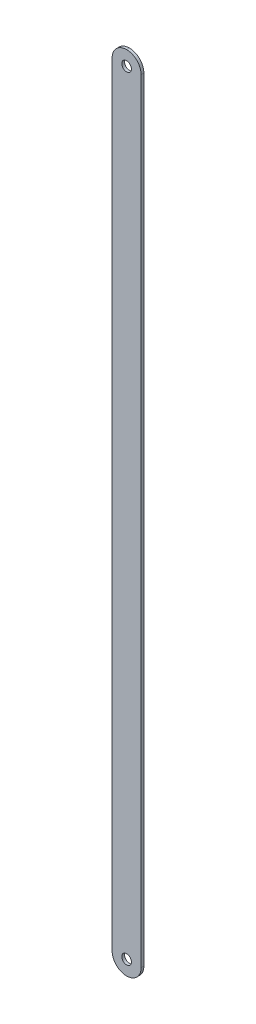
ISO-10303-21;
HEADER;
FILE_DESCRIPTION(('STEP AP214'),'2;1');
FILE_NAME('part.step','',(''),(''),'','','');
FILE_SCHEMA(('AUTOMOTIVE_DESIGN { 1 0 10303 214 1 1 1 1 }'));
ENDSEC;
DATA;
#1=APPLICATION_CONTEXT('core data for automotive mechanical design processes');
#2=APPLICATION_PROTOCOL_DEFINITION('international standard','automotive_design',2000,#1);
#3=PRODUCT_CONTEXT('',#1,'mechanical');
#4=PRODUCT('Part','Part','',(#3));
#5=PRODUCT_RELATED_PRODUCT_CATEGORY('part','',(#4));
#6=PRODUCT_DEFINITION_FORMATION('','',#4);
#7=PRODUCT_DEFINITION_CONTEXT('part definition',#1,'design');
#8=PRODUCT_DEFINITION('design','',#6,#7);
#9=PRODUCT_DEFINITION_SHAPE('','',#8);
#10=(LENGTH_UNIT() NAMED_UNIT(*) SI_UNIT(.MILLI.,.METRE.));
#11=(NAMED_UNIT(*) PLANE_ANGLE_UNIT() SI_UNIT($,.RADIAN.));
#12=(NAMED_UNIT(*) SI_UNIT($,.STERADIAN.) SOLID_ANGLE_UNIT());
#13=UNCERTAINTY_MEASURE_WITH_UNIT(LENGTH_MEASURE(1.E-05),#10,'distance_accuracy_value','');
#14=(GEOMETRIC_REPRESENTATION_CONTEXT(3) GLOBAL_UNCERTAINTY_ASSIGNED_CONTEXT((#13)) GLOBAL_UNIT_ASSIGNED_CONTEXT((#10,
#11,#12)) REPRESENTATION_CONTEXT('',''));
#15=CARTESIAN_POINT('',(0.,0.,0.));
#16=DIRECTION('',(0.,0.,1.));
#17=DIRECTION('',(1.,0.,0.));
#18=AXIS2_PLACEMENT_3D('',#15,#16,#17);
#19=CARTESIAN_POINT('',(-4.76250000000003,263.525000000001,0.911859999999876));
#20=DIRECTION('',(0.,0.,-0.999999999999998));
#21=DIRECTION('',(-1.,0.,0.));
#22=AXIS2_PLACEMENT_3D('',#19,#20,#21);
#23=PLANE('',#22);
#24=CARTESIAN_POINT('',(0.,258.7625,0.911859999999945));
#25=DIRECTION('',(0.,0.,0.999999999999998));
#26=DIRECTION('',(1.,0.,0.));
#27=AXIS2_PLACEMENT_3D('',#24,#25,#26);
#28=CIRCLE('',#27,1.58749999999999);
#29=CARTESIAN_POINT('',(1.58750000000001,258.7625,0.911859999999945));
#30=VERTEX_POINT('',#29);
#31=EDGE_CURVE('E114',#30,#30,#28,.T.);
#32=ORIENTED_EDGE('',*,*,#31,.F.);
#33=EDGE_LOOP('',(#32));
#34=FACE_BOUND('',#33,.T.);
#35=CARTESIAN_POINT('',(0.,4.76250000000011,0.91186));
#36=DIRECTION('',(0.,0.,0.999999999999998));
#37=DIRECTION('',(1.,0.,0.));
#38=AXIS2_PLACEMENT_3D('',#35,#36,#37);
#39=CIRCLE('',#38,1.58749999999999);
#40=CARTESIAN_POINT('',(1.58750000000001,4.76250000000011,0.91186));
#41=VERTEX_POINT('',#40);
#42=EDGE_CURVE('E171',#41,#41,#39,.T.);
#43=ORIENTED_EDGE('',*,*,#42,.F.);
#44=EDGE_LOOP('',(#43));
#45=FACE_BOUND('',#44,.T.);
#46=DIRECTION('',(0.,-1.,0.));
#47=VECTOR('',#46,1.);
#48=CARTESIAN_POINT('',(-4.76250000000003,263.525000000001,0.911859999999876));
#49=LINE('',#48,#47);
#50=CARTESIAN_POINT('',(-4.76250000000002,258.7625,0.911859999999876));
#51=VERTEX_POINT('',#50);
#52=CARTESIAN_POINT('',(-4.76250000000001,4.76249999999986,0.91185999999982));
#53=VERTEX_POINT('',#52);
#54=EDGE_CURVE('E159',#51,#53,#49,.T.);
#55=ORIENTED_EDGE('',*,*,#54,.T.);
#56=CARTESIAN_POINT('',(0.,4.76250000000011,0.91186));
#57=DIRECTION('',(0.,0.,-0.999999999999998));
#58=DIRECTION('',(-1.,0.,0.));
#59=AXIS2_PLACEMENT_3D('',#56,#57,#58);
#60=CIRCLE('',#59,4.7625);
#61=CARTESIAN_POINT('',(0.,0.,0.91186));
#62=VERTEX_POINT('',#61);
#63=EDGE_CURVE('E137',#53,#62,#60,.F.);
#64=ORIENTED_EDGE('',*,*,#63,.T.);
#65=CARTESIAN_POINT('',(0.,4.76250000000011,0.91186));
#66=DIRECTION('',(0.,0.,-0.999999999999998));
#67=DIRECTION('',(-1.,0.,0.));
#68=AXIS2_PLACEMENT_3D('',#65,#66,#67);
#69=CIRCLE('',#68,4.7625);
#70=CARTESIAN_POINT('',(4.76250000000001,4.76249999999986,0.91186));
#71=VERTEX_POINT('',#70);
#72=EDGE_CURVE('E64',#62,#71,#69,.F.);
#73=ORIENTED_EDGE('',*,*,#72,.T.);
#74=DIRECTION('',(0.,-1.,0.));
#75=VECTOR('',#74,1.);
#76=CARTESIAN_POINT('',(4.7625,263.525,0.911859999999945));
#77=LINE('',#76,#75);
#78=CARTESIAN_POINT('',(4.7625,258.7625,0.911859999999876));
#79=VERTEX_POINT('',#78);
#80=EDGE_CURVE('E145',#79,#71,#77,.T.);
#81=ORIENTED_EDGE('',*,*,#80,.F.);
#82=CARTESIAN_POINT('',(0.,258.7625,0.911859999999945));
#83=DIRECTION('',(0.,0.,-0.999999999999998));
#84=DIRECTION('',(-1.,0.,0.));
#85=AXIS2_PLACEMENT_3D('',#82,#83,#84);
#86=CIRCLE('',#85,4.7625);
#87=CARTESIAN_POINT('',(0.,263.525000000001,0.91186));
#88=VERTEX_POINT('',#87);
#89=EDGE_CURVE('E58',#79,#88,#86,.F.);
#90=ORIENTED_EDGE('',*,*,#89,.T.);
#91=CARTESIAN_POINT('',(0.,258.7625,0.911859999999945));
#92=DIRECTION('',(0.,0.,-0.999999999999998));
#93=DIRECTION('',(-1.,0.,0.));
#94=AXIS2_PLACEMENT_3D('',#91,#92,#93);
#95=CIRCLE('',#94,4.7625);
#96=EDGE_CURVE('E132',#88,#51,#95,.F.);
#97=ORIENTED_EDGE('',*,*,#96,.T.);
#98=EDGE_LOOP('',(#55,#64,#73,#81,#90,#97));
#99=FACE_BOUND('',#98,.T.);
#100=ADVANCED_FACE('F40',(#34,#45,#99),#23,.F.);
#101=CARTESIAN_POINT('',(4.7625,263.525,0.));
#102=DIRECTION('',(1.,0.,0.));
#103=DIRECTION('',(0.,0.,-0.999999999999998));
#104=AXIS2_PLACEMENT_3D('',#101,#102,#103);
#105=PLANE('',#104);
#106=ORIENTED_EDGE('',*,*,#80,.T.);
#107=DIRECTION('',(0.,0.,0.999999999999998));
#108=VECTOR('',#107,1.);
#109=CARTESIAN_POINT('',(4.7625,4.76249999999986,0.));
#110=LINE('',#109,#108);
#111=CARTESIAN_POINT('',(4.7625,4.76249999999986,0.));
#112=VERTEX_POINT('',#111);
#113=EDGE_CURVE('E11',#71,#112,#110,.F.);
#114=ORIENTED_EDGE('',*,*,#113,.T.);
#115=DIRECTION('',(0.,-1.,0.));
#116=VECTOR('',#115,1.);
#117=CARTESIAN_POINT('',(4.7625,263.525,0.));
#118=LINE('',#117,#116);
#119=CARTESIAN_POINT('',(4.76249999999999,258.7625,-1.2490009027033E-13));
#120=VERTEX_POINT('',#119);
#121=EDGE_CURVE('E103',#120,#112,#118,.T.);
#122=ORIENTED_EDGE('',*,*,#121,.F.);
#123=DIRECTION('',(0.,0.,0.999999999999998));
#124=VECTOR('',#123,1.);
#125=CARTESIAN_POINT('',(4.7625,258.7625,0.911859999999876));
#126=LINE('',#125,#124);
#127=EDGE_CURVE('E50',#120,#79,#126,.T.);
#128=ORIENTED_EDGE('',*,*,#127,.T.);
#129=EDGE_LOOP('',(#106,#114,#122,#128));
#130=FACE_BOUND('',#129,.T.);
#131=ADVANCED_FACE('F144',(#130),#105,.T.);
#132=CARTESIAN_POINT('',(-4.76250000000003,263.525000000001,-1.2490009027033E-13));
#133=DIRECTION('',(0.,0.,-0.999999999999998));
#134=DIRECTION('',(-1.,0.,0.));
#135=AXIS2_PLACEMENT_3D('',#132,#133,#134);
#136=PLANE('',#135);
#137=CARTESIAN_POINT('',(0.,258.7625,0.));
#138=DIRECTION('',(0.,0.,0.999999999999998));
#139=DIRECTION('',(1.,0.,0.));
#140=AXIS2_PLACEMENT_3D('',#137,#138,#139);
#141=CIRCLE('',#140,1.5875);
#142=CARTESIAN_POINT('',(1.58750000000001,258.7625,0.));
#143=VERTEX_POINT('',#142);
#144=EDGE_CURVE('E188',#143,#143,#141,.T.);
#145=ORIENTED_EDGE('',*,*,#144,.T.);
#146=EDGE_LOOP('',(#145));
#147=FACE_BOUND('',#146,.T.);
#148=CARTESIAN_POINT('',(0.,4.76250000000011,0.));
#149=DIRECTION('',(0.,0.,0.999999999999998));
#150=DIRECTION('',(1.,0.,0.));
#151=AXIS2_PLACEMENT_3D('',#148,#149,#150);
#152=CIRCLE('',#151,1.5875);
#153=CARTESIAN_POINT('',(1.58750000000001,4.76250000000011,0.));
#154=VERTEX_POINT('',#153);
#155=EDGE_CURVE('E164',#154,#154,#152,.T.);
#156=ORIENTED_EDGE('',*,*,#155,.T.);
#157=EDGE_LOOP('',(#156));
#158=FACE_BOUND('',#157,.T.);
#159=CARTESIAN_POINT('',(0.,4.76250000000011,0.));
#160=DIRECTION('',(0.,0.,-0.999999999999998));
#161=DIRECTION('',(-1.,0.,0.));
#162=AXIS2_PLACEMENT_3D('',#159,#160,#161);
#163=CIRCLE('',#162,4.7625);
#164=CARTESIAN_POINT('',(0.,0.,0.));
#165=VERTEX_POINT('',#164);
#166=EDGE_CURVE('E95',#112,#165,#163,.T.);
#167=ORIENTED_EDGE('',*,*,#166,.T.);
#168=CARTESIAN_POINT('',(0.,4.76250000000011,0.));
#169=DIRECTION('',(0.,0.,-0.999999999999998));
#170=DIRECTION('',(-1.,0.,0.));
#171=AXIS2_PLACEMENT_3D('',#168,#169,#170);
#172=CIRCLE('',#171,4.7625);
#173=CARTESIAN_POINT('',(-4.76250000000001,4.76249999999986,-1.80411241501588E-13));
#174=VERTEX_POINT('',#173);
#175=EDGE_CURVE('E100',#165,#174,#172,.T.);
#176=ORIENTED_EDGE('',*,*,#175,.T.);
#177=DIRECTION('',(0.,-1.,0.));
#178=VECTOR('',#177,1.);
#179=CARTESIAN_POINT('',(-4.76250000000003,263.525000000001,-1.2490009027033E-13));
#180=LINE('',#179,#178);
#181=CARTESIAN_POINT('',(-4.76250000000002,258.7625,-1.2490009027033E-13));
#182=VERTEX_POINT('',#181);
#183=EDGE_CURVE('E163',#182,#174,#180,.T.);
#184=ORIENTED_EDGE('',*,*,#183,.F.);
#185=CARTESIAN_POINT('',(0.,258.7625,0.));
#186=DIRECTION('',(0.,0.,-0.999999999999998));
#187=DIRECTION('',(-1.,0.,0.));
#188=AXIS2_PLACEMENT_3D('',#185,#186,#187);
#189=CIRCLE('',#188,4.7625);
#190=CARTESIAN_POINT('',(0.,263.525000000001,0.));
#191=VERTEX_POINT('',#190);
#192=EDGE_CURVE('E107',#182,#191,#189,.T.);
#193=ORIENTED_EDGE('',*,*,#192,.T.);
#194=CARTESIAN_POINT('',(0.,258.7625,0.));
#195=DIRECTION('',(0.,0.,-0.999999999999998));
#196=DIRECTION('',(-1.,0.,0.));
#197=AXIS2_PLACEMENT_3D('',#194,#195,#196);
#198=CIRCLE('',#197,4.7625);
#199=EDGE_CURVE('E150',#191,#120,#198,.T.);
#200=ORIENTED_EDGE('',*,*,#199,.T.);
#201=ORIENTED_EDGE('',*,*,#121,.T.);
#202=EDGE_LOOP('',(#167,#176,#184,#193,#200,#201));
#203=FACE_BOUND('',#202,.T.);
#204=ADVANCED_FACE('F97',(#147,#158,#203),#136,.T.);
#205=CARTESIAN_POINT('',(-4.76250000000003,263.525000000001,0.911859999999876));
#206=DIRECTION('',(-1.,0.,0.));
#207=DIRECTION('',(0.,0.,0.999999999999998));
#208=AXIS2_PLACEMENT_3D('',#205,#206,#207);
#209=PLANE('',#208);
#210=ORIENTED_EDGE('',*,*,#183,.T.);
#211=DIRECTION('',(0.,0.,-0.999999999999998));
#212=VECTOR('',#211,1.);
#213=CARTESIAN_POINT('',(-4.76250000000001,4.76249999999986,0.91185999999982));
#214=LINE('',#213,#212);
#215=EDGE_CURVE('E118',#174,#53,#214,.F.);
#216=ORIENTED_EDGE('',*,*,#215,.T.);
#217=ORIENTED_EDGE('',*,*,#54,.F.);
#218=DIRECTION('',(0.,0.,-0.999999999999998));
#219=VECTOR('',#218,1.);
#220=CARTESIAN_POINT('',(-4.76250000000002,258.7625,-1.2490009027033E-13));
#221=LINE('',#220,#219);
#222=EDGE_CURVE('E120',#51,#182,#221,.T.);
#223=ORIENTED_EDGE('',*,*,#222,.T.);
#224=EDGE_LOOP('',(#210,#216,#217,#223));
#225=FACE_BOUND('',#224,.T.);
#226=ADVANCED_FACE('F161',(#225),#209,.T.);
#227=CARTESIAN_POINT('',(0.,4.76250000000011,0.91186));
#228=DIRECTION('',(0.,0.,0.999999999999998));
#229=DIRECTION('',(1.,0.,0.));
#230=AXIS2_PLACEMENT_3D('',#227,#228,#229);
#231=CYLINDRICAL_SURFACE('',#230,1.58749999999999);
#232=ORIENTED_EDGE('',*,*,#155,.F.);
#233=EDGE_LOOP('',(#232));
#234=FACE_BOUND('',#233,.T.);
#235=ORIENTED_EDGE('',*,*,#42,.T.);
#236=EDGE_LOOP('',(#235));
#237=FACE_BOUND('',#236,.T.);
#238=ADVANCED_FACE('F204',(#234,#237),#231,.F.);
#239=CARTESIAN_POINT('',(0.,258.7625,0.911859999999945));
#240=DIRECTION('',(0.,0.,0.999999999999998));
#241=DIRECTION('',(1.,0.,0.));
#242=AXIS2_PLACEMENT_3D('',#239,#240,#241);
#243=CYLINDRICAL_SURFACE('',#242,1.58749999999999);
#244=ORIENTED_EDGE('',*,*,#144,.F.);
#245=EDGE_LOOP('',(#244));
#246=FACE_BOUND('',#245,.T.);
#247=ORIENTED_EDGE('',*,*,#31,.T.);
#248=EDGE_LOOP('',(#247));
#249=FACE_BOUND('',#248,.T.);
#250=ADVANCED_FACE('F197',(#246,#249),#243,.F.);
#251=CARTESIAN_POINT('',(0.,4.76250000000011,0.));
#252=DIRECTION('',(0.,0.,0.999999999999998));
#253=DIRECTION('',(1.,0.,0.));
#254=AXIS2_PLACEMENT_3D('',#251,#252,#253);
#255=CYLINDRICAL_SURFACE('',#254,4.7625);
#256=ORIENTED_EDGE('',*,*,#113,.F.);
#257=ORIENTED_EDGE('',*,*,#72,.F.);
#258=DIRECTION('',(0.,0.,0.999999999999998));
#259=VECTOR('',#258,1.);
#260=CARTESIAN_POINT('',(0.,0.,0.));
#261=LINE('',#260,#259);
#262=EDGE_CURVE('E110',#165,#62,#261,.T.);
#263=ORIENTED_EDGE('',*,*,#262,.F.);
#264=ORIENTED_EDGE('',*,*,#166,.F.);
#265=EDGE_LOOP('',(#256,#257,#263,#264));
#266=FACE_BOUND('',#265,.T.);
#267=ADVANCED_FACE('F111',(#266),#255,.T.);
#268=CARTESIAN_POINT('',(0.,4.76250000000011,0.));
#269=DIRECTION('',(0.,0.,-0.999999999999998));
#270=DIRECTION('',(-1.,0.,0.));
#271=AXIS2_PLACEMENT_3D('',#268,#269,#270);
#272=CYLINDRICAL_SURFACE('',#271,4.7625);
#273=ORIENTED_EDGE('',*,*,#63,.F.);
#274=ORIENTED_EDGE('',*,*,#215,.F.);
#275=ORIENTED_EDGE('',*,*,#175,.F.);
#276=ORIENTED_EDGE('',*,*,#262,.T.);
#277=EDGE_LOOP('',(#273,#274,#275,#276));
#278=FACE_BOUND('',#277,.T.);
#279=ADVANCED_FACE('F116',(#278),#272,.T.);
#280=CARTESIAN_POINT('',(0.,258.7625,0.));
#281=DIRECTION('',(0.,0.,-0.999999999999998));
#282=DIRECTION('',(-1.,0.,0.));
#283=AXIS2_PLACEMENT_3D('',#280,#281,#282);
#284=CYLINDRICAL_SURFACE('',#283,4.7625);
#285=DIRECTION('',(0.,0.,0.999999999999998));
#286=VECTOR('',#285,1.);
#287=CARTESIAN_POINT('',(0.,263.525000000001,0.));
#288=LINE('',#287,#286);
#289=EDGE_CURVE('E44',#88,#191,#288,.F.);
#290=ORIENTED_EDGE('',*,*,#289,.F.);
#291=ORIENTED_EDGE('',*,*,#89,.F.);
#292=ORIENTED_EDGE('',*,*,#127,.F.);
#293=ORIENTED_EDGE('',*,*,#199,.F.);
#294=EDGE_LOOP('',(#290,#291,#292,#293));
#295=FACE_BOUND('',#294,.T.);
#296=ADVANCED_FACE('F42',(#295),#284,.T.);
#297=CARTESIAN_POINT('',(0.,258.7625,0.911859999999945));
#298=DIRECTION('',(0.,0.,0.999999999999998));
#299=DIRECTION('',(1.,0.,0.));
#300=AXIS2_PLACEMENT_3D('',#297,#298,#299);
#301=CYLINDRICAL_SURFACE('',#300,4.7625);
#302=ORIENTED_EDGE('',*,*,#96,.F.);
#303=ORIENTED_EDGE('',*,*,#289,.T.);
#304=ORIENTED_EDGE('',*,*,#192,.F.);
#305=ORIENTED_EDGE('',*,*,#222,.F.);
#306=EDGE_LOOP('',(#302,#303,#304,#305));
#307=FACE_BOUND('',#306,.T.);
#308=ADVANCED_FACE('F157',(#307),#301,.T.);
#309=CLOSED_SHELL('',(#100,#131,#204,#226,#238,#250,#267,#279,#296,#308));
#310=MANIFOLD_SOLID_BREP('B2',#309);
#311=ADVANCED_BREP_SHAPE_REPRESENTATION('',(#18,#310),#14);
#312=SHAPE_DEFINITION_REPRESENTATION(#9,#311);
ENDSEC;
END-ISO-10303-21;
